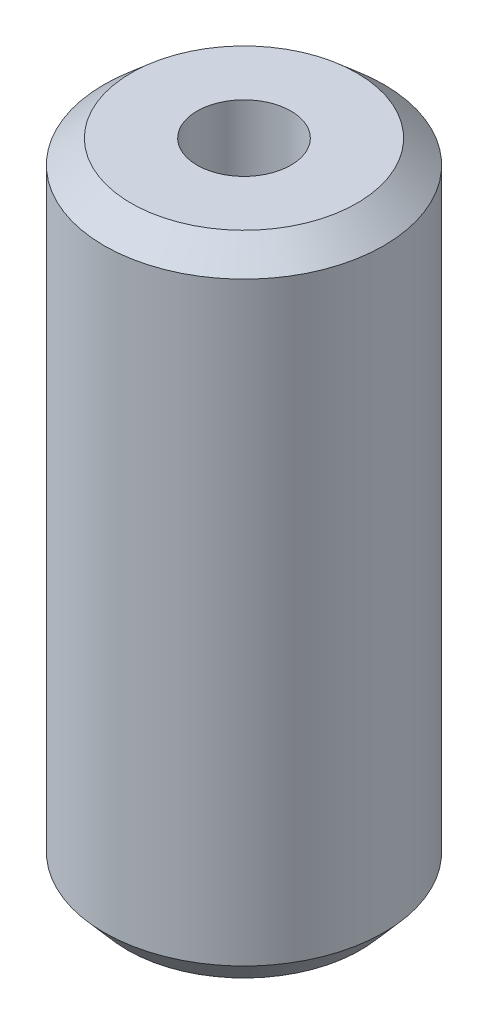
ISO-10303-21;
HEADER;
FILE_DESCRIPTION(('STEP AP214'),'2;1');
FILE_NAME('part.step','',(''),(''),'','','');
FILE_SCHEMA(('AUTOMOTIVE_DESIGN { 1 0 10303 214 1 1 1 1 }'));
ENDSEC;
DATA;
#1=APPLICATION_CONTEXT('core data for automotive mechanical design processes');
#2=APPLICATION_PROTOCOL_DEFINITION('international standard','automotive_design',2000,#1);
#3=PRODUCT_CONTEXT('',#1,'mechanical');
#4=PRODUCT('Part','Part','',(#3));
#5=PRODUCT_RELATED_PRODUCT_CATEGORY('part','',(#4));
#6=PRODUCT_DEFINITION_FORMATION('','',#4);
#7=PRODUCT_DEFINITION_CONTEXT('part definition',#1,'design');
#8=PRODUCT_DEFINITION('design','',#6,#7);
#9=PRODUCT_DEFINITION_SHAPE('','',#8);
#10=(LENGTH_UNIT() NAMED_UNIT(*) SI_UNIT(.MILLI.,.METRE.));
#11=(NAMED_UNIT(*) PLANE_ANGLE_UNIT() SI_UNIT($,.RADIAN.));
#12=(NAMED_UNIT(*) SI_UNIT($,.STERADIAN.) SOLID_ANGLE_UNIT());
#13=UNCERTAINTY_MEASURE_WITH_UNIT(LENGTH_MEASURE(1.E-05),#10,'distance_accuracy_value','');
#14=(GEOMETRIC_REPRESENTATION_CONTEXT(3) GLOBAL_UNCERTAINTY_ASSIGNED_CONTEXT((#13)) GLOBAL_UNIT_ASSIGNED_CONTEXT((#10,
#11,#12)) REPRESENTATION_CONTEXT('',''));
#15=CARTESIAN_POINT('',(0.,0.,0.));
#16=DIRECTION('',(0.,0.,1.));
#17=DIRECTION('',(1.,0.,0.));
#18=AXIS2_PLACEMENT_3D('',#15,#16,#17);
#19=CARTESIAN_POINT('',(0.,103.86064012596,0.));
#20=DIRECTION('',(0.,-1.,0.));
#21=DIRECTION('',(0.,0.,-1.));
#22=AXIS2_PLACEMENT_3D('',#19,#20,#21);
#23=CYLINDRICAL_SURFACE('',#22,22.5);
#24=CARTESIAN_POINT('',(0.,100.101544929274,0.));
#25=DIRECTION('',(0.,1.,0.));
#26=DIRECTION('',(0.,0.,1.));
#27=AXIS2_PLACEMENT_3D('',#24,#25,#26);
#28=CIRCLE('',#27,22.5);
#29=CARTESIAN_POINT('',(0.,100.101544929274,-22.5));
#30=VERTEX_POINT('',#29);
#31=EDGE_CURVE('E50',#30,#30,#28,.F.);
#32=ORIENTED_EDGE('',*,*,#31,.T.);
#33=EDGE_LOOP('',(#32));
#34=FACE_BOUND('',#33,.T.);
#35=CARTESIAN_POINT('',(0.,4.32351152479422,0.));
#36=DIRECTION('',(0.,1.,0.));
#37=DIRECTION('',(0.,0.,1.));
#38=AXIS2_PLACEMENT_3D('',#35,#36,#37);
#39=CIRCLE('',#38,22.5);
#40=CARTESIAN_POINT('',(0.,4.32351152479422,22.5));
#41=VERTEX_POINT('',#40);
#42=EDGE_CURVE('E51',#41,#41,#39,.T.);
#43=ORIENTED_EDGE('',*,*,#42,.T.);
#44=EDGE_LOOP('',(#43));
#45=FACE_BOUND('',#44,.T.);
#46=ADVANCED_FACE('F39',(#34,#45),#23,.T.);
#47=CARTESIAN_POINT('',(0.,103.86064012596,0.));
#48=DIRECTION('',(0.,1.,0.));
#49=DIRECTION('',(0.,0.,1.));
#50=AXIS2_PLACEMENT_3D('',#47,#48,#49);
#51=PLANE('',#50);
#52=CARTESIAN_POINT('',(0.,103.86064012596,0.));
#53=DIRECTION('',(0.,1.,0.));
#54=DIRECTION('',(0.,0.,1.));
#55=AXIS2_PLACEMENT_3D('',#52,#53,#54);
#56=CIRCLE('',#55,18.1764884752057);
#57=CARTESIAN_POINT('',(0.,103.86064012596,-18.1764884752057));
#58=VERTEX_POINT('',#57);
#59=EDGE_CURVE('E54',#58,#58,#56,.T.);
#60=ORIENTED_EDGE('',*,*,#59,.T.);
#61=EDGE_LOOP('',(#60));
#62=FACE_BOUND('',#61,.T.);
#63=CARTESIAN_POINT('',(0.,103.86064012596,0.));
#64=DIRECTION('',(0.,1.,0.));
#65=DIRECTION('',(0.,0.,1.));
#66=AXIS2_PLACEMENT_3D('',#63,#64,#65);
#67=CIRCLE('',#66,7.55769272410564);
#68=CARTESIAN_POINT('',(0.,103.86064012596,7.55769272410564));
#69=VERTEX_POINT('',#68);
#70=EDGE_CURVE('E58',#69,#69,#67,.T.);
#71=ORIENTED_EDGE('',*,*,#70,.F.);
#72=EDGE_LOOP('',(#71));
#73=FACE_BOUND('',#72,.T.);
#74=ADVANCED_FACE('F69',(#62,#73),#51,.T.);
#75=CARTESIAN_POINT('',(0.,0.,0.));
#76=DIRECTION('',(0.,1.,0.));
#77=DIRECTION('',(0.,0.,1.));
#78=AXIS2_PLACEMENT_3D('',#75,#76,#77);
#79=PLANE('',#78);
#80=CARTESIAN_POINT('',(0.,0.,0.));
#81=DIRECTION('',(0.,1.,0.));
#82=DIRECTION('',(0.,0.,1.));
#83=AXIS2_PLACEMENT_3D('',#80,#81,#82);
#84=CIRCLE('',#83,18.7409048033138);
#85=CARTESIAN_POINT('',(0.,0.,18.7409048033138));
#86=VERTEX_POINT('',#85);
#87=EDGE_CURVE('E10',#86,#86,#84,.F.);
#88=ORIENTED_EDGE('',*,*,#87,.T.);
#89=EDGE_LOOP('',(#88));
#90=FACE_BOUND('',#89,.T.);
#91=CARTESIAN_POINT('',(0.,0.,0.));
#92=DIRECTION('',(0.,1.,0.));
#93=DIRECTION('',(0.,0.,1.));
#94=AXIS2_PLACEMENT_3D('',#91,#92,#93);
#95=CIRCLE('',#94,7.55769272410564);
#96=CARTESIAN_POINT('',(0.,0.,7.55769272410564));
#97=VERTEX_POINT('',#96);
#98=EDGE_CURVE('E63',#97,#97,#95,.T.);
#99=ORIENTED_EDGE('',*,*,#98,.T.);
#100=EDGE_LOOP('',(#99));
#101=FACE_BOUND('',#100,.T.);
#102=ADVANCED_FACE('F75',(#90,#101),#79,.F.);
#103=CARTESIAN_POINT('',(0.,103.86064012596,0.));
#104=DIRECTION('',(0.,-1.,0.));
#105=DIRECTION('',(0.,0.,-1.));
#106=AXIS2_PLACEMENT_3D('',#103,#104,#105);
#107=CYLINDRICAL_SURFACE('',#106,7.55769272410564);
#108=ORIENTED_EDGE('',*,*,#70,.T.);
#109=EDGE_LOOP('',(#108));
#110=FACE_BOUND('',#109,.T.);
#111=ORIENTED_EDGE('',*,*,#98,.F.);
#112=EDGE_LOOP('',(#111));
#113=FACE_BOUND('',#112,.T.);
#114=ADVANCED_FACE('F70',(#110,#113),#107,.F.);
#115=CARTESIAN_POINT('',(0.,103.86064012596,0.));
#116=DIRECTION('',(0.,-1.,0.));
#117=DIRECTION('',(0.,0.,-1.));
#118=AXIS2_PLACEMENT_3D('',#115,#116,#117);
#119=CONICAL_SURFACE('',#118,18.1764884752057,0.855115964724982);
#120=CARTESIAN_POINT('',(0.,100.101544929274,-22.5));
#121=CARTESIAN_POINT('',(0.,100.140702170906,-22.4549634216167));
#122=CARTESIAN_POINT('',(0.,100.179859412538,-22.4099268432335));
#123=CARTESIAN_POINT('',(0.,100.258173895802,-22.3198536864669));
#124=CARTESIAN_POINT('',(0.,100.297331137434,-22.2748171080836));
#125=CARTESIAN_POINT('',(0.,100.375645620699,-22.1847439513171));
#126=CARTESIAN_POINT('',(0.,100.414802862331,-22.1397073729338));
#127=CARTESIAN_POINT('',(0.,100.493117345595,-22.0496342161673));
#128=CARTESIAN_POINT('',(0.,100.532274587227,-22.004597637784));
#129=CARTESIAN_POINT('',(0.,100.610589070492,-21.9145244810175));
#130=CARTESIAN_POINT('',(0.,100.649746312124,-21.8694879026342));
#131=CARTESIAN_POINT('',(0.,100.728060795388,-21.7794147458676));
#132=CARTESIAN_POINT('',(0.,100.76721803702,-21.7343781674844));
#133=CARTESIAN_POINT('',(0.,100.845532520284,-21.6443050107178));
#134=CARTESIAN_POINT('',(0.,100.884689761917,-21.5992684323345));
#135=CARTESIAN_POINT('',(0.,100.963004245181,-21.509195275568));
#136=CARTESIAN_POINT('',(0.,101.002161486813,-21.4641586971847));
#137=CARTESIAN_POINT('',(0.,101.080475970077,-21.3740855404182));
#138=CARTESIAN_POINT('',(0.,101.119633211709,-21.3290489620349));
#139=CARTESIAN_POINT('',(0.,101.197947694974,-21.2389758052684));
#140=CARTESIAN_POINT('',(0.,101.237104936606,-21.1939392268851));
#141=CARTESIAN_POINT('',(0.,101.31541941987,-21.1038660701185));
#142=CARTESIAN_POINT('',(0.,101.354576661502,-21.0588294917353));
#143=CARTESIAN_POINT('',(0.,101.432891144767,-20.9687563349687));
#144=CARTESIAN_POINT('',(0.,101.472048386399,-20.9237197565854));
#145=CARTESIAN_POINT('',(0.,101.550362869663,-20.8336465998189));
#146=CARTESIAN_POINT('',(0.,101.589520111295,-20.7886100214356));
#147=CARTESIAN_POINT('',(0.,101.66783459456,-20.6985368646691));
#148=CARTESIAN_POINT('',(0.,101.706991836192,-20.6535002862858));
#149=CARTESIAN_POINT('',(0.,101.785306319456,-20.5634271295192));
#150=CARTESIAN_POINT('',(0.,101.824463561088,-20.518390551136));
#151=CARTESIAN_POINT('',(0.,101.902778044352,-20.4283173943694));
#152=CARTESIAN_POINT('',(0.,101.941935285985,-20.3832808159862));
#153=CARTESIAN_POINT('',(0.,102.020249769249,-20.2932076592196));
#154=CARTESIAN_POINT('',(0.,102.059407010881,-20.2481710808363));
#155=CARTESIAN_POINT('',(0.,102.137721494145,-20.1580979240698));
#156=CARTESIAN_POINT('',(0.,102.176878735778,-20.1130613456865));
#157=CARTESIAN_POINT('',(0.,102.255193219042,-20.02298818892));
#158=CARTESIAN_POINT('',(0.,102.294350460674,-19.9779516105367));
#159=CARTESIAN_POINT('',(0.,102.372664943938,-19.8878784537701));
#160=CARTESIAN_POINT('',(0.,102.41182218557,-19.8428418753869));
#161=CARTESIAN_POINT('',(0.,102.490136668835,-19.7527687186203));
#162=CARTESIAN_POINT('',(0.,102.529293910467,-19.707732140237));
#163=CARTESIAN_POINT('',(0.,102.607608393731,-19.6176589834705));
#164=CARTESIAN_POINT('',(0.,102.646765635363,-19.5726224050872));
#165=CARTESIAN_POINT('',(0.,102.725080118628,-19.4825492483207));
#166=CARTESIAN_POINT('',(0.,102.76423736026,-19.4375126699374));
#167=CARTESIAN_POINT('',(0.,102.842551843524,-19.3474395131709));
#168=CARTESIAN_POINT('',(0.,102.881709085156,-19.3024029347876));
#169=CARTESIAN_POINT('',(0.,102.96002356842,-19.212329778021));
#170=CARTESIAN_POINT('',(0.,102.999180810053,-19.1672931996378));
#171=CARTESIAN_POINT('',(0.,103.077495293317,-19.0772200428712));
#172=CARTESIAN_POINT('',(0.,103.116652534949,-19.0321834644879));
#173=CARTESIAN_POINT('',(0.,103.194967018213,-18.9421103077214));
#174=CARTESIAN_POINT('',(0.,103.234124259846,-18.8970737293381));
#175=CARTESIAN_POINT('',(0.,103.31243874311,-18.8070005725716));
#176=CARTESIAN_POINT('',(0.,103.351595984742,-18.7619639941883));
#177=CARTESIAN_POINT('',(0.,103.429910468006,-18.6718908374218));
#178=CARTESIAN_POINT('',(0.,103.469067709638,-18.6268542590385));
#179=CARTESIAN_POINT('',(0.,103.547382192903,-18.5367811022719));
#180=CARTESIAN_POINT('',(0.,103.586539434535,-18.4917445238887));
#181=CARTESIAN_POINT('',(0.,103.664853917799,-18.4016713671221));
#182=CARTESIAN_POINT('',(0.,103.704011159431,-18.3566347887388));
#183=CARTESIAN_POINT('',(0.,103.782325642696,-18.2665616319723));
#184=CARTESIAN_POINT('',(0.,103.821482884328,-18.221525053589));
#185=CARTESIAN_POINT('',(0.,103.86064012596,-18.1764884752057));
#186=B_SPLINE_CURVE_WITH_KNOTS('',3,(#120,#121,#122,#123,#124,#125,#126,#127,#128,#129,#130,
#131,#132,#133,#134,#135,#136,#137,#138,#139,#140,#141,#142,#143,#144,#145,#146,#147,#148,#149,
#150,#151,#152,#153,#154,#155,#156,#157,#158,#159,#160,#161,#162,#163,#164,#165,#166,#167,#168,
#169,#170,#171,#172,#173,#174,#175,#176,#177,#178,#179,#180,#181,#182,#183,#184,#185),
.UNSPECIFIED.,.F.,.F.,(4,2,2,2,2,2,2,2,2,2,2,2,2,2,2,2,2,2,2,2,2,2,2,2,2,2,2,2,2,2,2,2,4),(0.,
0.179036998082522,0.358073996165039,0.537110994247562,0.716147992330088,0.89518499041261,
1.07422198849513,1.25325898657766,1.43229598466018,1.6113329827427,1.79036998082522,
1.96940697890774,2.14844397699026,2.32748097507278,2.5065179731553,2.68555497123783,
2.86459196932035,3.04362896740287,3.2226659654854,3.40170296356792,3.58073996165044,
3.75977695973296,3.93881395781549,4.11785095589801,4.29688795398053,4.47592495206306,
4.65496195014558,4.8339989482281,5.01303594631062,5.19207294439315,5.37110994247567,
5.55014694055819,5.72918393864072),.UNSPECIFIED.);
#187=EDGE_CURVE('BSEAM81',#30,#58,#186,.T.);
#188=ORIENTED_EDGE('',*,*,#31,.F.);
#189=ORIENTED_EDGE('',*,*,#59,.F.);
#190=ORIENTED_EDGE('',*,*,#187,.T.);
#191=ORIENTED_EDGE('',*,*,#187,.F.);
#192=EDGE_LOOP('',(#188,#190,#189,#191));
#193=FACE_BOUND('',#192,.T.);
#194=ADVANCED_FACE('F81',(#193),#119,.T.);
#195=CARTESIAN_POINT('',(0.,4.32351152479422,0.));
#196=DIRECTION('',(0.,1.,0.));
#197=DIRECTION('',(0.,0.,1.));
#198=AXIS2_PLACEMENT_3D('',#195,#196,#197);
#199=CONICAL_SURFACE('',#198,22.5,0.715680362069914);
#200=ORIENTED_EDGE('',*,*,#87,.F.);
#201=EDGE_LOOP('',(#200));
#202=FACE_BOUND('',#201,.T.);
#203=ORIENTED_EDGE('',*,*,#42,.F.);
#204=EDGE_LOOP('',(#203));
#205=FACE_BOUND('',#204,.T.);
#206=ADVANCED_FACE('F45',(#202,#205),#199,.T.);
#207=CLOSED_SHELL('',(#46,#74,#102,#114,#194,#206));
#208=MANIFOLD_SOLID_BREP('B2',#207);
#209=ADVANCED_BREP_SHAPE_REPRESENTATION('',(#18,#208),#14);
#210=SHAPE_DEFINITION_REPRESENTATION(#9,#209);
ENDSEC;
END-ISO-10303-21;
